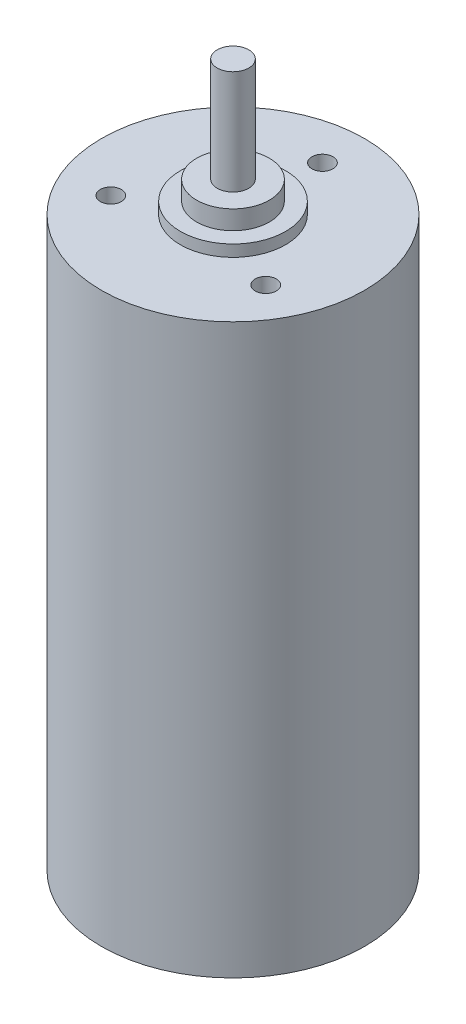
ISO-10303-21;
HEADER;
FILE_DESCRIPTION(('STEP AP214'),'2;1');
FILE_NAME('part.step','',(''),(''),'','','');
FILE_SCHEMA(('AUTOMOTIVE_DESIGN { 1 0 10303 214 1 1 1 1 }'));
ENDSEC;
DATA;
#1=APPLICATION_CONTEXT('core data for automotive mechanical design processes');
#2=APPLICATION_PROTOCOL_DEFINITION('international standard','automotive_design',2000,#1);
#3=PRODUCT_CONTEXT('',#1,'mechanical');
#4=PRODUCT('Part','Part','',(#3));
#5=PRODUCT_RELATED_PRODUCT_CATEGORY('part','',(#4));
#6=PRODUCT_DEFINITION_FORMATION('','',#4);
#7=PRODUCT_DEFINITION_CONTEXT('part definition',#1,'design');
#8=PRODUCT_DEFINITION('design','',#6,#7);
#9=PRODUCT_DEFINITION_SHAPE('','',#8);
#10=(LENGTH_UNIT() NAMED_UNIT(*) SI_UNIT(.MILLI.,.METRE.));
#11=(NAMED_UNIT(*) PLANE_ANGLE_UNIT() SI_UNIT($,.RADIAN.));
#12=(NAMED_UNIT(*) SI_UNIT($,.STERADIAN.) SOLID_ANGLE_UNIT());
#13=UNCERTAINTY_MEASURE_WITH_UNIT(LENGTH_MEASURE(1.E-05),#10,'distance_accuracy_value','');
#14=(GEOMETRIC_REPRESENTATION_CONTEXT(3) GLOBAL_UNCERTAINTY_ASSIGNED_CONTEXT((#13)) GLOBAL_UNIT_ASSIGNED_CONTEXT((#10,
#11,#12)) REPRESENTATION_CONTEXT('',''));
#15=CARTESIAN_POINT('',(0.,0.,0.));
#16=DIRECTION('',(0.,0.,1.));
#17=DIRECTION('',(1.,0.,0.));
#18=AXIS2_PLACEMENT_3D('',#15,#16,#17);
#19=CARTESIAN_POINT('',(0.,56.9,0.));
#20=DIRECTION('',(0.,1.,0.));
#21=DIRECTION('',(0.,0.,1.));
#22=AXIS2_PLACEMENT_3D('',#19,#20,#21);
#23=PLANE('',#22);
#24=CARTESIAN_POINT('',(0.,56.9,0.));
#25=DIRECTION('',(0.,1.,0.));
#26=DIRECTION('',(0.,0.,1.));
#27=AXIS2_PLACEMENT_3D('',#24,#25,#26);
#28=CIRCLE('',#27,3.45515003498981);
#29=CARTESIAN_POINT('',(0.,56.9,3.45515003498981));
#30=VERTEX_POINT('',#29);
#31=EDGE_CURVE('E86',#30,#30,#28,.T.);
#32=ORIENTED_EDGE('',*,*,#31,.T.);
#33=EDGE_LOOP('',(#32));
#34=FACE_BOUND('',#33,.T.);
#35=CARTESIAN_POINT('',(0.,56.9,0.));
#36=DIRECTION('',(0.,1.,0.));
#37=DIRECTION('',(0.,0.,1.));
#38=AXIS2_PLACEMENT_3D('',#35,#36,#37);
#39=CIRCLE('',#38,1.5);
#40=CARTESIAN_POINT('',(0.,56.9,1.5));
#41=VERTEX_POINT('',#40);
#42=EDGE_CURVE('E79',#41,#41,#39,.T.);
#43=ORIENTED_EDGE('',*,*,#42,.F.);
#44=EDGE_LOOP('',(#43));
#45=FACE_BOUND('',#44,.T.);
#46=ADVANCED_FACE('F34',(#34,#45),#23,.T.);
#47=CARTESIAN_POINT('',(0.,55.1,0.));
#48=DIRECTION('',(0.,1.,0.));
#49=DIRECTION('',(0.,0.,1.));
#50=AXIS2_PLACEMENT_3D('',#47,#48,#49);
#51=PLANE('',#50);
#52=CARTESIAN_POINT('',(0.,55.1,0.));
#53=DIRECTION('',(0.,1.,0.));
#54=DIRECTION('',(0.,0.,1.));
#55=AXIS2_PLACEMENT_3D('',#52,#53,#54);
#56=CIRCLE('',#55,5.);
#57=CARTESIAN_POINT('',(0.,55.1,5.));
#58=VERTEX_POINT('',#57);
#59=EDGE_CURVE('E92',#58,#58,#56,.T.);
#60=ORIENTED_EDGE('',*,*,#59,.T.);
#61=EDGE_LOOP('',(#60));
#62=FACE_BOUND('',#61,.T.);
#63=CARTESIAN_POINT('',(0.,55.1,0.));
#64=DIRECTION('',(0.,1.,0.));
#65=DIRECTION('',(0.,0.,1.));
#66=AXIS2_PLACEMENT_3D('',#63,#64,#65);
#67=CIRCLE('',#66,3.45515003498981);
#68=CARTESIAN_POINT('',(0.,55.1,3.45515003498981));
#69=VERTEX_POINT('',#68);
#70=EDGE_CURVE('E83',#69,#69,#67,.T.);
#71=ORIENTED_EDGE('',*,*,#70,.F.);
#72=EDGE_LOOP('',(#71));
#73=FACE_BOUND('',#72,.T.);
#74=ADVANCED_FACE('F102',(#62,#73),#51,.T.);
#75=CARTESIAN_POINT('',(0.,54.,0.));
#76=DIRECTION('',(0.,1.,0.));
#77=DIRECTION('',(0.,0.,1.));
#78=AXIS2_PLACEMENT_3D('',#75,#76,#77);
#79=PLANE('',#78);
#80=CARTESIAN_POINT('',(-7.36121593216774,54.,4.24999999999998));
#81=DIRECTION('',(0.,1.,0.));
#82=DIRECTION('',(0.,0.,1.));
#83=AXIS2_PLACEMENT_3D('',#80,#81,#82);
#84=CIRCLE('',#83,0.999999999999997);
#85=CARTESIAN_POINT('',(-7.36121593216774,54.,5.24999999999998));
#86=VERTEX_POINT('',#85);
#87=EDGE_CURVE('E63',#86,#86,#84,.T.);
#88=ORIENTED_EDGE('',*,*,#87,.F.);
#89=EDGE_LOOP('',(#88));
#90=FACE_BOUND('',#89,.T.);
#91=CARTESIAN_POINT('',(0.,54.,-8.5));
#92=DIRECTION('',(0.,1.,0.));
#93=DIRECTION('',(0.,0.,1.));
#94=AXIS2_PLACEMENT_3D('',#91,#92,#93);
#95=CIRCLE('',#94,0.999999999999998);
#96=CARTESIAN_POINT('',(0.,54.,-7.5));
#97=VERTEX_POINT('',#96);
#98=EDGE_CURVE('E62',#97,#97,#95,.T.);
#99=ORIENTED_EDGE('',*,*,#98,.F.);
#100=EDGE_LOOP('',(#99));
#101=FACE_BOUND('',#100,.T.);
#102=CARTESIAN_POINT('',(7.36121593216774,54.,4.24999999999998));
#103=DIRECTION('',(0.,1.,0.));
#104=DIRECTION('',(0.,0.,1.));
#105=AXIS2_PLACEMENT_3D('',#102,#103,#104);
#106=CIRCLE('',#105,0.999999999999997);
#107=CARTESIAN_POINT('',(7.36121593216774,54.,5.24999999999998));
#108=VERTEX_POINT('',#107);
#109=EDGE_CURVE('E73',#108,#108,#106,.T.);
#110=ORIENTED_EDGE('',*,*,#109,.F.);
#111=EDGE_LOOP('',(#110));
#112=FACE_BOUND('',#111,.T.);
#113=CARTESIAN_POINT('',(0.,54.,0.));
#114=DIRECTION('',(0.,1.,0.));
#115=DIRECTION('',(0.,0.,1.));
#116=AXIS2_PLACEMENT_3D('',#113,#114,#115);
#117=CIRCLE('',#116,12.5);
#118=CARTESIAN_POINT('',(0.,54.,12.5));
#119=VERTEX_POINT('',#118);
#120=EDGE_CURVE('E11',#119,#119,#117,.T.);
#121=ORIENTED_EDGE('',*,*,#120,.T.);
#122=EDGE_LOOP('',(#121));
#123=FACE_BOUND('',#122,.T.);
#124=CARTESIAN_POINT('',(0.,54.,0.));
#125=DIRECTION('',(0.,1.,0.));
#126=DIRECTION('',(0.,0.,1.));
#127=AXIS2_PLACEMENT_3D('',#124,#125,#126);
#128=CIRCLE('',#127,5.);
#129=CARTESIAN_POINT('',(0.,54.,5.));
#130=VERTEX_POINT('',#129);
#131=EDGE_CURVE('E89',#130,#130,#128,.T.);
#132=ORIENTED_EDGE('',*,*,#131,.F.);
#133=EDGE_LOOP('',(#132));
#134=FACE_BOUND('',#133,.T.);
#135=ADVANCED_FACE('F100',(#90,#101,#112,#123,#134),#79,.T.);
#136=CARTESIAN_POINT('',(0.,54.,0.));
#137=DIRECTION('',(0.,-1.,0.));
#138=DIRECTION('',(0.,0.,-1.));
#139=AXIS2_PLACEMENT_3D('',#136,#137,#138);
#140=CYLINDRICAL_SURFACE('',#139,12.5);
#141=ORIENTED_EDGE('',*,*,#120,.F.);
#142=EDGE_LOOP('',(#141));
#143=FACE_BOUND('',#142,.T.);
#144=CARTESIAN_POINT('',(0.,0.,0.));
#145=DIRECTION('',(0.,1.,0.));
#146=DIRECTION('',(0.,0.,1.));
#147=AXIS2_PLACEMENT_3D('',#144,#145,#146);
#148=CIRCLE('',#147,12.5);
#149=CARTESIAN_POINT('',(0.,0.,12.5));
#150=VERTEX_POINT('',#149);
#151=EDGE_CURVE('E38',#150,#150,#148,.T.);
#152=ORIENTED_EDGE('',*,*,#151,.T.);
#153=EDGE_LOOP('',(#152));
#154=FACE_BOUND('',#153,.T.);
#155=ADVANCED_FACE('F36',(#143,#154),#140,.T.);
#156=CARTESIAN_POINT('',(0.,0.,0.));
#157=DIRECTION('',(0.,1.,0.));
#158=DIRECTION('',(0.,0.,1.));
#159=AXIS2_PLACEMENT_3D('',#156,#157,#158);
#160=PLANE('',#159);
#161=ORIENTED_EDGE('',*,*,#151,.F.);
#162=EDGE_LOOP('',(#161));
#163=FACE_BOUND('',#162,.T.);
#164=ADVANCED_FACE('F109',(#163),#160,.F.);
#165=CARTESIAN_POINT('',(0.,55.1,0.));
#166=DIRECTION('',(0.,-1.,0.));
#167=DIRECTION('',(0.,0.,-1.));
#168=AXIS2_PLACEMENT_3D('',#165,#166,#167);
#169=CYLINDRICAL_SURFACE('',#168,5.);
#170=ORIENTED_EDGE('',*,*,#59,.F.);
#171=EDGE_LOOP('',(#170));
#172=FACE_BOUND('',#171,.T.);
#173=ORIENTED_EDGE('',*,*,#131,.T.);
#174=EDGE_LOOP('',(#173));
#175=FACE_BOUND('',#174,.T.);
#176=ADVANCED_FACE('F98',(#172,#175),#169,.T.);
#177=CARTESIAN_POINT('',(0.,56.9,0.));
#178=DIRECTION('',(0.,-1.,0.));
#179=DIRECTION('',(0.,0.,-1.));
#180=AXIS2_PLACEMENT_3D('',#177,#178,#179);
#181=CYLINDRICAL_SURFACE('',#180,3.45515003498981);
#182=ORIENTED_EDGE('',*,*,#31,.F.);
#183=EDGE_LOOP('',(#182));
#184=FACE_BOUND('',#183,.T.);
#185=ORIENTED_EDGE('',*,*,#70,.T.);
#186=EDGE_LOOP('',(#185));
#187=FACE_BOUND('',#186,.T.);
#188=ADVANCED_FACE('F126',(#184,#187),#181,.T.);
#189=CARTESIAN_POINT('',(0.,66.8,0.));
#190=DIRECTION('',(0.,-1.,0.));
#191=DIRECTION('',(0.,0.,-1.));
#192=AXIS2_PLACEMENT_3D('',#189,#190,#191);
#193=CYLINDRICAL_SURFACE('',#192,1.5);
#194=CARTESIAN_POINT('',(0.,66.8,0.));
#195=DIRECTION('',(0.,1.,0.));
#196=DIRECTION('',(0.,0.,1.));
#197=AXIS2_PLACEMENT_3D('',#194,#195,#196);
#198=CIRCLE('',#197,1.5);
#199=CARTESIAN_POINT('',(0.,66.8,1.5));
#200=VERTEX_POINT('',#199);
#201=EDGE_CURVE('E80',#200,#200,#198,.T.);
#202=ORIENTED_EDGE('',*,*,#201,.F.);
#203=EDGE_LOOP('',(#202));
#204=FACE_BOUND('',#203,.T.);
#205=ORIENTED_EDGE('',*,*,#42,.T.);
#206=EDGE_LOOP('',(#205));
#207=FACE_BOUND('',#206,.T.);
#208=ADVANCED_FACE('F124',(#204,#207),#193,.T.);
#209=CARTESIAN_POINT('',(0.,66.8,0.));
#210=DIRECTION('',(0.,1.,0.));
#211=DIRECTION('',(0.,0.,1.));
#212=AXIS2_PLACEMENT_3D('',#209,#210,#211);
#213=PLANE('',#212);
#214=ORIENTED_EDGE('',*,*,#201,.T.);
#215=EDGE_LOOP('',(#214));
#216=FACE_BOUND('',#215,.T.);
#217=ADVANCED_FACE('F163',(#216),#213,.T.);
#218=CARTESIAN_POINT('',(7.36121593216774,51.1000058,4.24999999999998));
#219=DIRECTION('',(0.,1.,0.));
#220=DIRECTION('',(0.,0.,1.));
#221=AXIS2_PLACEMENT_3D('',#218,#219,#220);
#222=CONICAL_SURFACE('',#221,0.999999999999997,1.02974425867665);
#223=CARTESIAN_POINT('',(7.36121593216774,50.4991451809724,4.24999999999998));
#224=VERTEX_POINT('',#223);
#225=VERTEX_LOOP('',#224);
#226=FACE_BOUND('',#225,.T.);
#227=CARTESIAN_POINT('',(7.36121593216774,51.1000058,4.24999999999998));
#228=DIRECTION('',(0.,1.,0.));
#229=DIRECTION('',(0.,0.,1.));
#230=AXIS2_PLACEMENT_3D('',#227,#228,#229);
#231=CIRCLE('',#230,0.999999999999997);
#232=CARTESIAN_POINT('',(7.36121593216774,51.1000058,5.24999999999998));
#233=VERTEX_POINT('',#232);
#234=EDGE_CURVE('E76',#233,#233,#231,.T.);
#235=ORIENTED_EDGE('',*,*,#234,.T.);
#236=EDGE_LOOP('',(#235));
#237=FACE_BOUND('',#236,.T.);
#238=ADVANCED_FACE('F168',(#226,#237),#222,.F.);
#239=CARTESIAN_POINT('',(7.36121593216774,54.,4.24999999999998));
#240=DIRECTION('',(0.,1.,0.));
#241=DIRECTION('',(0.,0.,1.));
#242=AXIS2_PLACEMENT_3D('',#239,#240,#241);
#243=CYLINDRICAL_SURFACE('',#242,0.999999999999997);
#244=ORIENTED_EDGE('',*,*,#234,.F.);
#245=EDGE_LOOP('',(#244));
#246=FACE_BOUND('',#245,.T.);
#247=ORIENTED_EDGE('',*,*,#109,.T.);
#248=EDGE_LOOP('',(#247));
#249=FACE_BOUND('',#248,.T.);
#250=ADVANCED_FACE('F173',(#246,#249),#243,.F.);
#251=CARTESIAN_POINT('',(0.,51.1000058,-8.5));
#252=DIRECTION('',(0.,1.,0.));
#253=DIRECTION('',(0.,0.,1.));
#254=AXIS2_PLACEMENT_3D('',#251,#252,#253);
#255=CONICAL_SURFACE('',#254,0.999999999999997,1.02974425867665);
#256=CARTESIAN_POINT('',(0.,50.4991451809724,-8.5));
#257=VERTEX_POINT('',#256);
#258=VERTEX_LOOP('',#257);
#259=FACE_BOUND('',#258,.T.);
#260=CARTESIAN_POINT('',(0.,51.1000058,-8.5));
#261=DIRECTION('',(0.,1.,0.));
#262=DIRECTION('',(0.,0.,1.));
#263=AXIS2_PLACEMENT_3D('',#260,#261,#262);
#264=CIRCLE('',#263,0.999999999999997);
#265=CARTESIAN_POINT('',(0.,51.1000058,-7.5));
#266=VERTEX_POINT('',#265);
#267=EDGE_CURVE('E66',#266,#266,#264,.T.);
#268=ORIENTED_EDGE('',*,*,#267,.T.);
#269=EDGE_LOOP('',(#268));
#270=FACE_BOUND('',#269,.T.);
#271=ADVANCED_FACE('F182',(#259,#270),#255,.F.);
#272=CARTESIAN_POINT('',(0.,54.,-8.5));
#273=DIRECTION('',(0.,1.,0.));
#274=DIRECTION('',(0.,0.,1.));
#275=AXIS2_PLACEMENT_3D('',#272,#273,#274);
#276=CYLINDRICAL_SURFACE('',#275,0.999999999999998);
#277=ORIENTED_EDGE('',*,*,#267,.F.);
#278=EDGE_LOOP('',(#277));
#279=FACE_BOUND('',#278,.T.);
#280=ORIENTED_EDGE('',*,*,#98,.T.);
#281=EDGE_LOOP('',(#280));
#282=FACE_BOUND('',#281,.T.);
#283=ADVANCED_FACE('F56',(#279,#282),#276,.F.);
#284=CARTESIAN_POINT('',(-7.36121593216774,51.1000058,4.24999999999998));
#285=DIRECTION('',(0.,1.,0.));
#286=DIRECTION('',(0.,0.,1.));
#287=AXIS2_PLACEMENT_3D('',#284,#285,#286);
#288=CONICAL_SURFACE('',#287,0.999999999999997,1.02974425867665);
#289=CARTESIAN_POINT('',(-7.36121593216774,50.4991451809724,4.24999999999998));
#290=VERTEX_POINT('',#289);
#291=VERTEX_LOOP('',#290);
#292=FACE_BOUND('',#291,.T.);
#293=CARTESIAN_POINT('',(-7.36121593216774,51.1000058,4.24999999999998));
#294=DIRECTION('',(0.,1.,0.));
#295=DIRECTION('',(0.,0.,1.));
#296=AXIS2_PLACEMENT_3D('',#293,#294,#295);
#297=CIRCLE('',#296,0.999999999999997);
#298=CARTESIAN_POINT('',(-7.36121593216774,51.1000058,5.24999999999998));
#299=VERTEX_POINT('',#298);
#300=EDGE_CURVE('E60',#299,#299,#297,.T.);
#301=ORIENTED_EDGE('',*,*,#300,.T.);
#302=EDGE_LOOP('',(#301));
#303=FACE_BOUND('',#302,.T.);
#304=ADVANCED_FACE('F52',(#292,#303),#288,.F.);
#305=CARTESIAN_POINT('',(-7.36121593216774,54.,4.24999999999998));
#306=DIRECTION('',(0.,1.,0.));
#307=DIRECTION('',(0.,0.,1.));
#308=AXIS2_PLACEMENT_3D('',#305,#306,#307);
#309=CYLINDRICAL_SURFACE('',#308,0.999999999999997);
#310=ORIENTED_EDGE('',*,*,#300,.F.);
#311=EDGE_LOOP('',(#310));
#312=FACE_BOUND('',#311,.T.);
#313=ORIENTED_EDGE('',*,*,#87,.T.);
#314=EDGE_LOOP('',(#313));
#315=FACE_BOUND('',#314,.T.);
#316=ADVANCED_FACE('F55',(#312,#315),#309,.F.);
#317=CLOSED_SHELL('',(#46,#74,#135,#155,#164,#176,#188,#208,#217,#238,#250,#271,#283,#304,#316));
#318=MANIFOLD_SOLID_BREP('B2',#317);
#319=ADVANCED_BREP_SHAPE_REPRESENTATION('',(#18,#318),#14);
#320=SHAPE_DEFINITION_REPRESENTATION(#9,#319);
ENDSEC;
END-ISO-10303-21;
